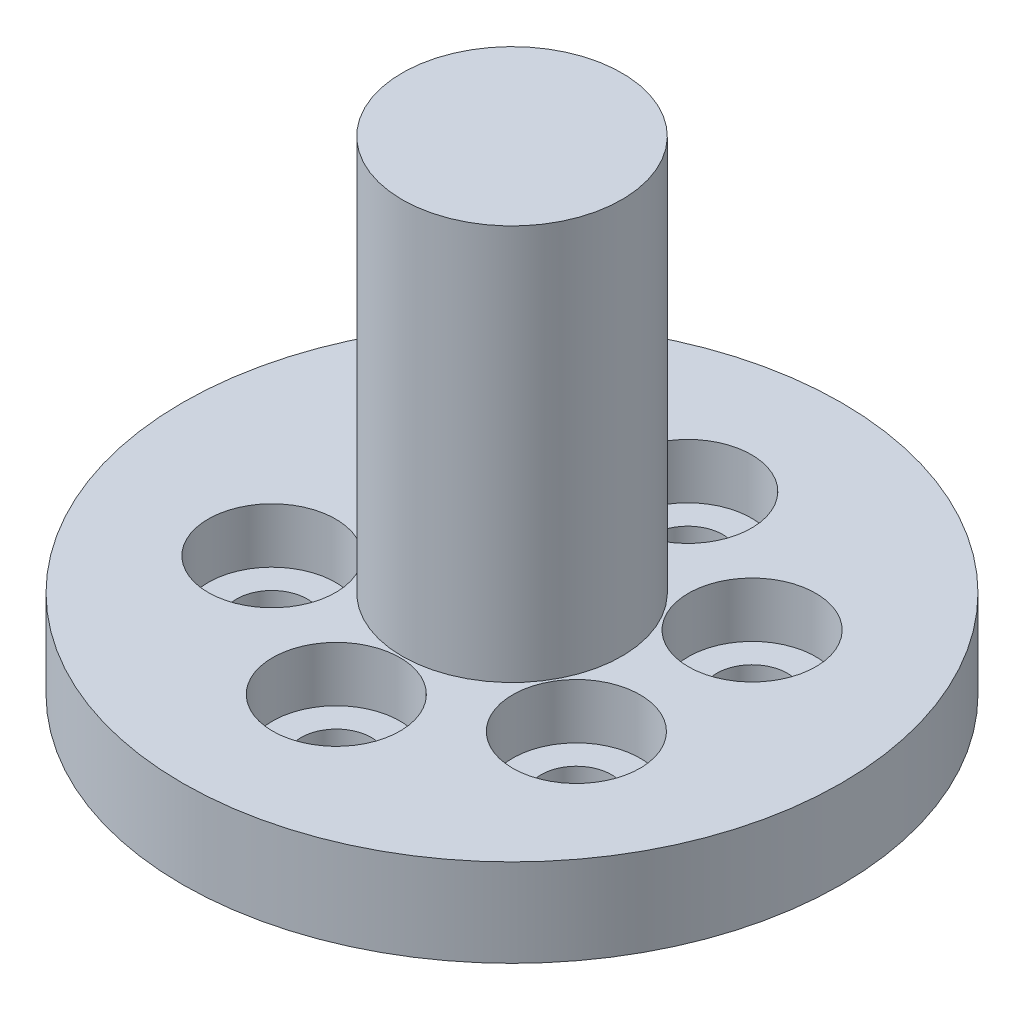
ISO-10303-21;
HEADER;
FILE_DESCRIPTION(('STEP AP214'),'2;1');
FILE_NAME('part.step','',(''),(''),'','','');
FILE_SCHEMA(('AUTOMOTIVE_DESIGN { 1 0 10303 214 1 1 1 1 }'));
ENDSEC;
DATA;
#1=APPLICATION_CONTEXT('core data for automotive mechanical design processes');
#2=APPLICATION_PROTOCOL_DEFINITION('international standard','automotive_design',2000,#1);
#3=PRODUCT_CONTEXT('',#1,'mechanical');
#4=PRODUCT('Part','Part','',(#3));
#5=PRODUCT_RELATED_PRODUCT_CATEGORY('part','',(#4));
#6=PRODUCT_DEFINITION_FORMATION('','',#4);
#7=PRODUCT_DEFINITION_CONTEXT('part definition',#1,'design');
#8=PRODUCT_DEFINITION('design','',#6,#7);
#9=PRODUCT_DEFINITION_SHAPE('','',#8);
#10=(LENGTH_UNIT() NAMED_UNIT(*) SI_UNIT(.MILLI.,.METRE.));
#11=(NAMED_UNIT(*) PLANE_ANGLE_UNIT() SI_UNIT($,.RADIAN.));
#12=(NAMED_UNIT(*) SI_UNIT($,.STERADIAN.) SOLID_ANGLE_UNIT());
#13=UNCERTAINTY_MEASURE_WITH_UNIT(LENGTH_MEASURE(1.E-05),#10,'distance_accuracy_value','');
#14=(GEOMETRIC_REPRESENTATION_CONTEXT(3) GLOBAL_UNCERTAINTY_ASSIGNED_CONTEXT((#13)) GLOBAL_UNIT_ASSIGNED_CONTEXT((#10,
#11,#12)) REPRESENTATION_CONTEXT('',''));
#15=CARTESIAN_POINT('',(0.,0.,0.));
#16=DIRECTION('',(0.,0.,1.));
#17=DIRECTION('',(1.,0.,0.));
#18=AXIS2_PLACEMENT_3D('',#15,#16,#17);
#19=CARTESIAN_POINT('',(6.92820323027568,-1.,-4.0000000000003));
#20=DIRECTION('',(0.,1.,0.));
#21=DIRECTION('',(0.,0.,1.));
#22=AXIS2_PLACEMENT_3D('',#19,#20,#21);
#23=CYLINDRICAL_SURFACE('',#22,1.6000000000001);
#24=CARTESIAN_POINT('',(6.92820323027568,0.,-4.0000000000003));
#25=DIRECTION('',(0.,1.,0.));
#26=DIRECTION('',(0.,0.,1.));
#27=AXIS2_PLACEMENT_3D('',#24,#25,#26);
#28=CIRCLE('',#27,1.6000000000001);
#29=CARTESIAN_POINT('',(6.92820323027568,0.,-2.4000000000002));
#30=VERTEX_POINT('',#29);
#31=EDGE_CURVE('E51',#30,#30,#28,.T.);
#32=ORIENTED_EDGE('',*,*,#31,.F.);
#33=EDGE_LOOP('',(#32));
#34=FACE_BOUND('',#33,.T.);
#35=CARTESIAN_POINT('',(6.92820323027568,1.5,-4.0000000000003));
#36=DIRECTION('',(0.,1.,0.));
#37=DIRECTION('',(0.,0.,1.));
#38=AXIS2_PLACEMENT_3D('',#35,#36,#37);
#39=CIRCLE('',#38,1.6000000000001);
#40=CARTESIAN_POINT('',(6.92820323027568,1.5,-2.4000000000002));
#41=VERTEX_POINT('',#40);
#42=EDGE_CURVE('E36',#41,#41,#39,.F.);
#43=ORIENTED_EDGE('',*,*,#42,.F.);
#44=EDGE_LOOP('',(#43));
#45=FACE_BOUND('',#44,.T.);
#46=ADVANCED_FACE('F32',(#34,#45),#23,.F.);
#47=CARTESIAN_POINT('',(6.92820323027602,-1.,3.9999999999997));
#48=DIRECTION('',(0.,1.,0.));
#49=DIRECTION('',(0.,0.,1.));
#50=AXIS2_PLACEMENT_3D('',#47,#48,#49);
#51=CYLINDRICAL_SURFACE('',#50,1.60000000000044);
#52=CARTESIAN_POINT('',(6.92820323027602,0.,3.9999999999997));
#53=DIRECTION('',(0.,1.,0.));
#54=DIRECTION('',(0.,0.,1.));
#55=AXIS2_PLACEMENT_3D('',#52,#53,#54);
#56=CIRCLE('',#55,1.60000000000044);
#57=CARTESIAN_POINT('',(6.92820323027602,0.,5.60000000000014));
#58=VERTEX_POINT('',#57);
#59=EDGE_CURVE('E54',#58,#58,#56,.T.);
#60=ORIENTED_EDGE('',*,*,#59,.F.);
#61=EDGE_LOOP('',(#60));
#62=FACE_BOUND('',#61,.T.);
#63=CARTESIAN_POINT('',(6.92820323027602,1.5,3.9999999999997));
#64=DIRECTION('',(0.,1.,0.));
#65=DIRECTION('',(0.,0.,1.));
#66=AXIS2_PLACEMENT_3D('',#63,#64,#65);
#67=CIRCLE('',#66,1.60000000000044);
#68=CARTESIAN_POINT('',(6.92820323027602,1.5,5.60000000000014));
#69=VERTEX_POINT('',#68);
#70=EDGE_CURVE('E80',#69,#69,#67,.F.);
#71=ORIENTED_EDGE('',*,*,#70,.F.);
#72=EDGE_LOOP('',(#71));
#73=FACE_BOUND('',#72,.T.);
#74=ADVANCED_FACE('F90',(#62,#73),#51,.F.);
#75=CARTESIAN_POINT('',(6.79181874011743E-13,-1.,8.));
#76=DIRECTION('',(0.,1.,0.));
#77=DIRECTION('',(0.,0.,1.));
#78=AXIS2_PLACEMENT_3D('',#75,#76,#77);
#79=CYLINDRICAL_SURFACE('',#78,1.6000000000007);
#80=CARTESIAN_POINT('',(6.79181874011743E-13,0.,8.));
#81=DIRECTION('',(0.,1.,0.));
#82=DIRECTION('',(0.,0.,1.));
#83=AXIS2_PLACEMENT_3D('',#80,#81,#82);
#84=CIRCLE('',#83,1.6000000000007);
#85=CARTESIAN_POINT('',(6.79181874011743E-13,0.,9.6000000000007));
#86=VERTEX_POINT('',#85);
#87=EDGE_CURVE('E57',#86,#86,#84,.T.);
#88=ORIENTED_EDGE('',*,*,#87,.F.);
#89=EDGE_LOOP('',(#88));
#90=FACE_BOUND('',#89,.T.);
#91=CARTESIAN_POINT('',(6.79181874011743E-13,1.5,8.));
#92=DIRECTION('',(0.,1.,0.));
#93=DIRECTION('',(0.,0.,1.));
#94=AXIS2_PLACEMENT_3D('',#91,#92,#93);
#95=CIRCLE('',#94,1.6000000000007);
#96=CARTESIAN_POINT('',(6.79181874011743E-13,1.5,9.6000000000007));
#97=VERTEX_POINT('',#96);
#98=EDGE_CURVE('E78',#97,#97,#95,.F.);
#99=ORIENTED_EDGE('',*,*,#98,.F.);
#100=EDGE_LOOP('',(#99));
#101=FACE_BOUND('',#100,.T.);
#102=ADVANCED_FACE('F96',(#90,#101),#79,.F.);
#103=CARTESIAN_POINT('',(-6.928203230275,-1.,4.0000000000003));
#104=DIRECTION('',(0.,1.,0.));
#105=DIRECTION('',(0.,0.,1.));
#106=AXIS2_PLACEMENT_3D('',#103,#104,#105);
#107=CYLINDRICAL_SURFACE('',#106,1.60000000000065);
#108=CARTESIAN_POINT('',(-6.928203230275,0.,4.0000000000003));
#109=DIRECTION('',(0.,1.,0.));
#110=DIRECTION('',(0.,0.,1.));
#111=AXIS2_PLACEMENT_3D('',#108,#109,#110);
#112=CIRCLE('',#111,1.60000000000065);
#113=CARTESIAN_POINT('',(-6.928203230275,0.,5.60000000000095));
#114=VERTEX_POINT('',#113);
#115=EDGE_CURVE('E60',#114,#114,#112,.T.);
#116=ORIENTED_EDGE('',*,*,#115,.F.);
#117=EDGE_LOOP('',(#116));
#118=FACE_BOUND('',#117,.T.);
#119=CARTESIAN_POINT('',(-6.928203230275,1.5,4.0000000000003));
#120=DIRECTION('',(0.,1.,0.));
#121=DIRECTION('',(0.,0.,1.));
#122=AXIS2_PLACEMENT_3D('',#119,#120,#121);
#123=CIRCLE('',#122,1.60000000000065);
#124=CARTESIAN_POINT('',(-6.928203230275,1.5,5.60000000000095));
#125=VERTEX_POINT('',#124);
#126=EDGE_CURVE('E75',#125,#125,#123,.F.);
#127=ORIENTED_EDGE('',*,*,#126,.F.);
#128=EDGE_LOOP('',(#127));
#129=FACE_BOUND('',#128,.T.);
#130=ADVANCED_FACE('F106',(#118,#129),#107,.F.);
#131=CARTESIAN_POINT('',(-6.92820323027534,-1.,-3.9999999999997));
#132=DIRECTION('',(0.,1.,0.));
#133=DIRECTION('',(0.,0.,1.));
#134=AXIS2_PLACEMENT_3D('',#131,#132,#133);
#135=CYLINDRICAL_SURFACE('',#134,1.60000000000034);
#136=CARTESIAN_POINT('',(-6.92820323027534,0.,-3.9999999999997));
#137=DIRECTION('',(0.,1.,0.));
#138=DIRECTION('',(0.,0.,1.));
#139=AXIS2_PLACEMENT_3D('',#136,#137,#138);
#140=CIRCLE('',#139,1.60000000000034);
#141=CARTESIAN_POINT('',(-6.92820323027534,0.,-2.39999999999936));
#142=VERTEX_POINT('',#141);
#143=EDGE_CURVE('E63',#142,#142,#140,.T.);
#144=ORIENTED_EDGE('',*,*,#143,.F.);
#145=EDGE_LOOP('',(#144));
#146=FACE_BOUND('',#145,.T.);
#147=CARTESIAN_POINT('',(-6.92820323027534,1.5,-3.9999999999997));
#148=DIRECTION('',(0.,1.,0.));
#149=DIRECTION('',(0.,0.,1.));
#150=AXIS2_PLACEMENT_3D('',#147,#148,#149);
#151=CIRCLE('',#150,1.60000000000034);
#152=CARTESIAN_POINT('',(-6.92820323027534,1.5,-2.39999999999936));
#153=VERTEX_POINT('',#152);
#154=EDGE_CURVE('E71',#153,#153,#151,.F.);
#155=ORIENTED_EDGE('',*,*,#154,.F.);
#156=EDGE_LOOP('',(#155));
#157=FACE_BOUND('',#156,.T.);
#158=ADVANCED_FACE('F101',(#146,#157),#135,.F.);
#159=CARTESIAN_POINT('',(0.,-1.,-8.));
#160=DIRECTION('',(0.,1.,0.));
#161=DIRECTION('',(0.,0.,1.));
#162=AXIS2_PLACEMENT_3D('',#159,#160,#161);
#163=CYLINDRICAL_SURFACE('',#162,1.6);
#164=CARTESIAN_POINT('',(0.,0.,-8.));
#165=DIRECTION('',(0.,1.,0.));
#166=DIRECTION('',(0.,0.,1.));
#167=AXIS2_PLACEMENT_3D('',#164,#165,#166);
#168=CIRCLE('',#167,1.6);
#169=CARTESIAN_POINT('',(0.,0.,-6.4));
#170=VERTEX_POINT('',#169);
#171=EDGE_CURVE('E45',#170,#170,#168,.T.);
#172=ORIENTED_EDGE('',*,*,#171,.F.);
#173=EDGE_LOOP('',(#172));
#174=FACE_BOUND('',#173,.T.);
#175=CARTESIAN_POINT('',(0.,1.5,-8.));
#176=DIRECTION('',(0.,1.,0.));
#177=DIRECTION('',(0.,0.,1.));
#178=AXIS2_PLACEMENT_3D('',#175,#176,#177);
#179=CIRCLE('',#178,1.6);
#180=CARTESIAN_POINT('',(0.,1.5,-6.4));
#181=VERTEX_POINT('',#180);
#182=EDGE_CURVE('E68',#181,#181,#179,.F.);
#183=ORIENTED_EDGE('',*,*,#182,.F.);
#184=EDGE_LOOP('',(#183));
#185=FACE_BOUND('',#184,.T.);
#186=ADVANCED_FACE('F142',(#174,#185),#163,.F.);
#187=CARTESIAN_POINT('',(0.,4.,0.));
#188=DIRECTION('',(0.,-1.,0.));
#189=DIRECTION('',(0.,0.,-1.));
#190=AXIS2_PLACEMENT_3D('',#187,#188,#189);
#191=CYLINDRICAL_SURFACE('',#190,15.);
#192=CARTESIAN_POINT('',(0.,4.,0.));
#193=DIRECTION('',(0.,1.,0.));
#194=DIRECTION('',(0.,0.,1.));
#195=AXIS2_PLACEMENT_3D('',#192,#193,#194);
#196=CIRCLE('',#195,15.);
#197=CARTESIAN_POINT('',(0.,4.,15.));
#198=VERTEX_POINT('',#197);
#199=EDGE_CURVE('E10',#198,#198,#196,.T.);
#200=ORIENTED_EDGE('',*,*,#199,.F.);
#201=EDGE_LOOP('',(#200));
#202=FACE_BOUND('',#201,.T.);
#203=CARTESIAN_POINT('',(0.,0.,0.));
#204=DIRECTION('',(0.,1.,0.));
#205=DIRECTION('',(0.,0.,1.));
#206=AXIS2_PLACEMENT_3D('',#203,#204,#205);
#207=CIRCLE('',#206,15.);
#208=CARTESIAN_POINT('',(0.,0.,15.));
#209=VERTEX_POINT('',#208);
#210=EDGE_CURVE('E40',#209,#209,#207,.T.);
#211=ORIENTED_EDGE('',*,*,#210,.T.);
#212=EDGE_LOOP('',(#211));
#213=FACE_BOUND('',#212,.T.);
#214=ADVANCED_FACE('F34',(#202,#213),#191,.T.);
#215=CARTESIAN_POINT('',(0.,4.,0.));
#216=DIRECTION('',(0.,1.,0.));
#217=DIRECTION('',(0.,0.,1.));
#218=AXIS2_PLACEMENT_3D('',#215,#216,#217);
#219=PLANE('',#218);
#220=CARTESIAN_POINT('',(0.,4.,0.));
#221=DIRECTION('',(0.,1.,0.));
#222=DIRECTION('',(0.,0.,1.));
#223=AXIS2_PLACEMENT_3D('',#220,#221,#222);
#224=CIRCLE('',#223,5.);
#225=CARTESIAN_POINT('',(0.,4.,5.));
#226=VERTEX_POINT('',#225);
#227=EDGE_CURVE('E216',#226,#226,#224,.T.);
#228=ORIENTED_EDGE('',*,*,#227,.F.);
#229=EDGE_LOOP('',(#228));
#230=FACE_BOUND('',#229,.T.);
#231=CARTESIAN_POINT('',(6.92870323027552,4.,-4.00086602540377));
#232=DIRECTION('',(0.,1.,0.));
#233=DIRECTION('',(0.,0.,1.));
#234=AXIS2_PLACEMENT_3D('',#231,#232,#233);
#235=CIRCLE('',#234,2.9);
#236=CARTESIAN_POINT('',(6.92870323027552,4.,-1.10086602540377));
#237=VERTEX_POINT('',#236);
#238=EDGE_CURVE('E235',#237,#237,#235,.T.);
#239=ORIENTED_EDGE('',*,*,#238,.F.);
#240=EDGE_LOOP('',(#239));
#241=FACE_BOUND('',#240,.T.);
#242=CARTESIAN_POINT('',(6.92970323027549,4.,3.99913397459625));
#243=DIRECTION('',(0.,1.,0.));
#244=DIRECTION('',(0.,0.,1.));
#245=AXIS2_PLACEMENT_3D('',#242,#243,#244);
#246=CIRCLE('',#245,2.9);
#247=CARTESIAN_POINT('',(6.92970323027549,4.,6.89913397459625));
#248=VERTEX_POINT('',#247);
#249=EDGE_CURVE('E241',#248,#248,#246,.T.);
#250=ORIENTED_EDGE('',*,*,#249,.F.);
#251=EDGE_LOOP('',(#250));
#252=FACE_BOUND('',#251,.T.);
#253=CARTESIAN_POINT('',(0.00199999999994414,4.,8.));
#254=DIRECTION('',(0.,1.,0.));
#255=DIRECTION('',(0.,0.,1.));
#256=AXIS2_PLACEMENT_3D('',#253,#254,#255);
#257=CIRCLE('',#256,2.9);
#258=CARTESIAN_POINT('',(0.00199999999994414,4.,10.9));
#259=VERTEX_POINT('',#258);
#260=EDGE_CURVE('E247',#259,#259,#257,.T.);
#261=ORIENTED_EDGE('',*,*,#260,.F.);
#262=EDGE_LOOP('',(#261));
#263=FACE_BOUND('',#262,.T.);
#264=CARTESIAN_POINT('',(-6.92670323027555,4.,4.00086602540372));
#265=DIRECTION('',(0.,1.,0.));
#266=DIRECTION('',(0.,0.,1.));
#267=AXIS2_PLACEMENT_3D('',#264,#265,#266);
#268=CIRCLE('',#267,2.9);
#269=CARTESIAN_POINT('',(-6.92670323027555,4.,6.90086602540372));
#270=VERTEX_POINT('',#269);
#271=EDGE_CURVE('E229',#270,#270,#268,.T.);
#272=ORIENTED_EDGE('',*,*,#271,.F.);
#273=EDGE_LOOP('',(#272));
#274=FACE_BOUND('',#273,.T.);
#275=CARTESIAN_POINT('',(-6.92770323027546,4.,-3.9991339745963));
#276=DIRECTION('',(0.,1.,0.));
#277=DIRECTION('',(0.,0.,1.));
#278=AXIS2_PLACEMENT_3D('',#275,#276,#277);
#279=CIRCLE('',#278,2.9);
#280=CARTESIAN_POINT('',(-6.92770323027546,4.,-1.0991339745963));
#281=VERTEX_POINT('',#280);
#282=EDGE_CURVE('E224',#281,#281,#279,.T.);
#283=ORIENTED_EDGE('',*,*,#282,.F.);
#284=EDGE_LOOP('',(#283));
#285=FACE_BOUND('',#284,.T.);
#286=CARTESIAN_POINT('',(0.,4.,-8.));
#287=DIRECTION('',(0.,1.,0.));
#288=DIRECTION('',(0.,0.,1.));
#289=AXIS2_PLACEMENT_3D('',#286,#287,#288);
#290=CIRCLE('',#289,2.9);
#291=CARTESIAN_POINT('',(0.,4.,-5.1));
#292=VERTEX_POINT('',#291);
#293=EDGE_CURVE('E48',#292,#292,#290,.T.);
#294=ORIENTED_EDGE('',*,*,#293,.F.);
#295=EDGE_LOOP('',(#294));
#296=FACE_BOUND('',#295,.T.);
#297=ORIENTED_EDGE('',*,*,#199,.T.);
#298=EDGE_LOOP('',(#297));
#299=FACE_BOUND('',#298,.T.);
#300=ADVANCED_FACE('F111',(#230,#241,#252,#263,#274,#285,#296,#299),#219,.T.);
#301=CARTESIAN_POINT('',(0.,0.,0.));
#302=DIRECTION('',(0.,1.,0.));
#303=DIRECTION('',(0.,0.,1.));
#304=AXIS2_PLACEMENT_3D('',#301,#302,#303);
#305=PLANE('',#304);
#306=CARTESIAN_POINT('',(0.,0.,0.));
#307=DIRECTION('',(0.,-1.,0.));
#308=DIRECTION('',(0.,0.,-1.));
#309=AXIS2_PLACEMENT_3D('',#306,#307,#308);
#310=CIRCLE('',#309,4.);
#311=CARTESIAN_POINT('',(0.,0.,-4.));
#312=VERTEX_POINT('',#311);
#313=EDGE_CURVE('E127',#312,#312,#310,.T.);
#314=ORIENTED_EDGE('',*,*,#313,.F.);
#315=EDGE_LOOP('',(#314));
#316=FACE_BOUND('',#315,.T.);
#317=ORIENTED_EDGE('',*,*,#171,.T.);
#318=EDGE_LOOP('',(#317));
#319=FACE_BOUND('',#318,.T.);
#320=ORIENTED_EDGE('',*,*,#143,.T.);
#321=EDGE_LOOP('',(#320));
#322=FACE_BOUND('',#321,.T.);
#323=ORIENTED_EDGE('',*,*,#115,.T.);
#324=EDGE_LOOP('',(#323));
#325=FACE_BOUND('',#324,.T.);
#326=ORIENTED_EDGE('',*,*,#87,.T.);
#327=EDGE_LOOP('',(#326));
#328=FACE_BOUND('',#327,.T.);
#329=ORIENTED_EDGE('',*,*,#59,.T.);
#330=EDGE_LOOP('',(#329));
#331=FACE_BOUND('',#330,.T.);
#332=ORIENTED_EDGE('',*,*,#31,.T.);
#333=EDGE_LOOP('',(#332));
#334=FACE_BOUND('',#333,.T.);
#335=ORIENTED_EDGE('',*,*,#210,.F.);
#336=EDGE_LOOP('',(#335));
#337=FACE_BOUND('',#336,.T.);
#338=ADVANCED_FACE('F113',(#316,#319,#322,#325,#328,#331,#334,#337),#305,.F.);
#339=CARTESIAN_POINT('',(0.,1.5,-8.));
#340=DIRECTION('',(0.,1.,0.));
#341=DIRECTION('',(0.,0.,1.));
#342=AXIS2_PLACEMENT_3D('',#339,#340,#341);
#343=PLANE('',#342);
#344=CARTESIAN_POINT('',(0.,1.5,-8.));
#345=DIRECTION('',(0.,1.,0.));
#346=DIRECTION('',(0.,0.,1.));
#347=AXIS2_PLACEMENT_3D('',#344,#345,#346);
#348=CIRCLE('',#347,2.9);
#349=CARTESIAN_POINT('',(0.,1.5,-5.1));
#350=VERTEX_POINT('',#349);
#351=EDGE_CURVE('E72',#350,#350,#348,.T.);
#352=ORIENTED_EDGE('',*,*,#351,.T.);
#353=EDGE_LOOP('',(#352));
#354=FACE_BOUND('',#353,.T.);
#355=ORIENTED_EDGE('',*,*,#182,.T.);
#356=EDGE_LOOP('',(#355));
#357=FACE_BOUND('',#356,.T.);
#358=ADVANCED_FACE('F116',(#354,#357),#343,.T.);
#359=CARTESIAN_POINT('',(0.,1.5,-8.));
#360=DIRECTION('',(0.,1.,0.));
#361=DIRECTION('',(0.,0.,1.));
#362=AXIS2_PLACEMENT_3D('',#359,#360,#361);
#363=CYLINDRICAL_SURFACE('',#362,2.9);
#364=ORIENTED_EDGE('',*,*,#351,.F.);
#365=EDGE_LOOP('',(#364));
#366=FACE_BOUND('',#365,.T.);
#367=ORIENTED_EDGE('',*,*,#293,.T.);
#368=EDGE_LOOP('',(#367));
#369=FACE_BOUND('',#368,.T.);
#370=ADVANCED_FACE('F121',(#366,#369),#363,.F.);
#371=CARTESIAN_POINT('',(-6.92770323027546,1.5,-3.9991339745963));
#372=DIRECTION('',(0.,1.,0.));
#373=DIRECTION('',(0.,0.,1.));
#374=AXIS2_PLACEMENT_3D('',#371,#372,#373);
#375=PLANE('',#374);
#376=CARTESIAN_POINT('',(-6.92770323027546,1.5,-3.9991339745963));
#377=DIRECTION('',(0.,1.,0.));
#378=DIRECTION('',(0.,0.,1.));
#379=AXIS2_PLACEMENT_3D('',#376,#377,#378);
#380=CIRCLE('',#379,2.9);
#381=CARTESIAN_POINT('',(-6.92770323027546,1.5,-1.0991339745963));
#382=VERTEX_POINT('',#381);
#383=EDGE_CURVE('E226',#382,#382,#380,.T.);
#384=ORIENTED_EDGE('',*,*,#383,.T.);
#385=EDGE_LOOP('',(#384));
#386=FACE_BOUND('',#385,.T.);
#387=ORIENTED_EDGE('',*,*,#154,.T.);
#388=EDGE_LOOP('',(#387));
#389=FACE_BOUND('',#388,.T.);
#390=ADVANCED_FACE('F155',(#386,#389),#375,.T.);
#391=CARTESIAN_POINT('',(-6.92770323027546,1.5,-3.9991339745963));
#392=DIRECTION('',(0.,1.,0.));
#393=DIRECTION('',(0.,0.,1.));
#394=AXIS2_PLACEMENT_3D('',#391,#392,#393);
#395=CYLINDRICAL_SURFACE('',#394,2.9);
#396=ORIENTED_EDGE('',*,*,#383,.F.);
#397=EDGE_LOOP('',(#396));
#398=FACE_BOUND('',#397,.T.);
#399=ORIENTED_EDGE('',*,*,#282,.T.);
#400=EDGE_LOOP('',(#399));
#401=FACE_BOUND('',#400,.T.);
#402=ADVANCED_FACE('F166',(#398,#401),#395,.F.);
#403=CARTESIAN_POINT('',(-6.92670323027555,1.5,4.00086602540372));
#404=DIRECTION('',(0.,1.,0.));
#405=DIRECTION('',(0.,0.,1.));
#406=AXIS2_PLACEMENT_3D('',#403,#404,#405);
#407=PLANE('',#406);
#408=CARTESIAN_POINT('',(-6.92670323027555,1.5,4.00086602540372));
#409=DIRECTION('',(0.,1.,0.));
#410=DIRECTION('',(0.,0.,1.));
#411=AXIS2_PLACEMENT_3D('',#408,#409,#410);
#412=CIRCLE('',#411,2.9);
#413=CARTESIAN_POINT('',(-6.92670323027555,1.5,6.90086602540372));
#414=VERTEX_POINT('',#413);
#415=EDGE_CURVE('E250',#414,#414,#412,.T.);
#416=ORIENTED_EDGE('',*,*,#415,.T.);
#417=EDGE_LOOP('',(#416));
#418=FACE_BOUND('',#417,.T.);
#419=ORIENTED_EDGE('',*,*,#126,.T.);
#420=EDGE_LOOP('',(#419));
#421=FACE_BOUND('',#420,.T.);
#422=ADVANCED_FACE('F162',(#418,#421),#407,.T.);
#423=CARTESIAN_POINT('',(-6.92670323027555,1.5,4.00086602540372));
#424=DIRECTION('',(0.,1.,0.));
#425=DIRECTION('',(0.,0.,1.));
#426=AXIS2_PLACEMENT_3D('',#423,#424,#425);
#427=CYLINDRICAL_SURFACE('',#426,2.9);
#428=ORIENTED_EDGE('',*,*,#415,.F.);
#429=EDGE_LOOP('',(#428));
#430=FACE_BOUND('',#429,.T.);
#431=ORIENTED_EDGE('',*,*,#271,.T.);
#432=EDGE_LOOP('',(#431));
#433=FACE_BOUND('',#432,.T.);
#434=ADVANCED_FACE('F158',(#430,#433),#427,.F.);
#435=CARTESIAN_POINT('',(0.00199999999994414,1.5,8.));
#436=DIRECTION('',(0.,1.,0.));
#437=DIRECTION('',(0.,0.,1.));
#438=AXIS2_PLACEMENT_3D('',#435,#436,#437);
#439=PLANE('',#438);
#440=CARTESIAN_POINT('',(0.00199999999994414,1.5,8.));
#441=DIRECTION('',(0.,1.,0.));
#442=DIRECTION('',(0.,0.,1.));
#443=AXIS2_PLACEMENT_3D('',#440,#441,#442);
#444=CIRCLE('',#443,2.9);
#445=CARTESIAN_POINT('',(0.00199999999994414,1.5,10.9));
#446=VERTEX_POINT('',#445);
#447=EDGE_CURVE('E244',#446,#446,#444,.T.);
#448=ORIENTED_EDGE('',*,*,#447,.T.);
#449=EDGE_LOOP('',(#448));
#450=FACE_BOUND('',#449,.T.);
#451=ORIENTED_EDGE('',*,*,#98,.T.);
#452=EDGE_LOOP('',(#451));
#453=FACE_BOUND('',#452,.T.);
#454=ADVANCED_FACE('F161',(#450,#453),#439,.T.);
#455=CARTESIAN_POINT('',(0.00199999999994414,1.5,8.));
#456=DIRECTION('',(0.,1.,0.));
#457=DIRECTION('',(0.,0.,1.));
#458=AXIS2_PLACEMENT_3D('',#455,#456,#457);
#459=CYLINDRICAL_SURFACE('',#458,2.9);
#460=ORIENTED_EDGE('',*,*,#447,.F.);
#461=EDGE_LOOP('',(#460));
#462=FACE_BOUND('',#461,.T.);
#463=ORIENTED_EDGE('',*,*,#260,.T.);
#464=EDGE_LOOP('',(#463));
#465=FACE_BOUND('',#464,.T.);
#466=ADVANCED_FACE('F168',(#462,#465),#459,.F.);
#467=CARTESIAN_POINT('',(6.92970323027549,1.5,3.99913397459625));
#468=DIRECTION('',(0.,1.,0.));
#469=DIRECTION('',(0.,0.,1.));
#470=AXIS2_PLACEMENT_3D('',#467,#468,#469);
#471=PLANE('',#470);
#472=CARTESIAN_POINT('',(6.92970323027549,1.5,3.99913397459625));
#473=DIRECTION('',(0.,1.,0.));
#474=DIRECTION('',(0.,0.,1.));
#475=AXIS2_PLACEMENT_3D('',#472,#473,#474);
#476=CIRCLE('',#475,2.9);
#477=CARTESIAN_POINT('',(6.92970323027549,1.5,6.89913397459625));
#478=VERTEX_POINT('',#477);
#479=EDGE_CURVE('E238',#478,#478,#476,.T.);
#480=ORIENTED_EDGE('',*,*,#479,.T.);
#481=EDGE_LOOP('',(#480));
#482=FACE_BOUND('',#481,.T.);
#483=ORIENTED_EDGE('',*,*,#70,.T.);
#484=EDGE_LOOP('',(#483));
#485=FACE_BOUND('',#484,.T.);
#486=ADVANCED_FACE('F171',(#482,#485),#471,.T.);
#487=CARTESIAN_POINT('',(6.92970323027549,1.5,3.99913397459625));
#488=DIRECTION('',(0.,1.,0.));
#489=DIRECTION('',(0.,0.,1.));
#490=AXIS2_PLACEMENT_3D('',#487,#488,#489);
#491=CYLINDRICAL_SURFACE('',#490,2.9);
#492=ORIENTED_EDGE('',*,*,#479,.F.);
#493=EDGE_LOOP('',(#492));
#494=FACE_BOUND('',#493,.T.);
#495=ORIENTED_EDGE('',*,*,#249,.T.);
#496=EDGE_LOOP('',(#495));
#497=FACE_BOUND('',#496,.T.);
#498=ADVANCED_FACE('F176',(#494,#497),#491,.F.);
#499=CARTESIAN_POINT('',(6.92870323027552,1.5,-4.00086602540377));
#500=DIRECTION('',(0.,1.,0.));
#501=DIRECTION('',(0.,0.,1.));
#502=AXIS2_PLACEMENT_3D('',#499,#500,#501);
#503=PLANE('',#502);
#504=CARTESIAN_POINT('',(6.92870323027552,1.5,-4.00086602540377));
#505=DIRECTION('',(0.,1.,0.));
#506=DIRECTION('',(0.,0.,1.));
#507=AXIS2_PLACEMENT_3D('',#504,#505,#506);
#508=CIRCLE('',#507,2.9);
#509=CARTESIAN_POINT('',(6.92870323027552,1.5,-1.10086602540377));
#510=VERTEX_POINT('',#509);
#511=EDGE_CURVE('E232',#510,#510,#508,.T.);
#512=ORIENTED_EDGE('',*,*,#511,.T.);
#513=EDGE_LOOP('',(#512));
#514=FACE_BOUND('',#513,.T.);
#515=ORIENTED_EDGE('',*,*,#42,.T.);
#516=EDGE_LOOP('',(#515));
#517=FACE_BOUND('',#516,.T.);
#518=ADVANCED_FACE('F87',(#514,#517),#503,.T.);
#519=CARTESIAN_POINT('',(6.92870323027552,1.5,-4.00086602540377));
#520=DIRECTION('',(0.,1.,0.));
#521=DIRECTION('',(0.,0.,1.));
#522=AXIS2_PLACEMENT_3D('',#519,#520,#521);
#523=CYLINDRICAL_SURFACE('',#522,2.9);
#524=ORIENTED_EDGE('',*,*,#511,.F.);
#525=EDGE_LOOP('',(#524));
#526=FACE_BOUND('',#525,.T.);
#527=ORIENTED_EDGE('',*,*,#238,.T.);
#528=EDGE_LOOP('',(#527));
#529=FACE_BOUND('',#528,.T.);
#530=ADVANCED_FACE('F183',(#526,#529),#523,.F.);
#531=CARTESIAN_POINT('',(0.,22.,0.));
#532=DIRECTION('',(0.,-1.,0.));
#533=DIRECTION('',(0.,0.,-1.));
#534=AXIS2_PLACEMENT_3D('',#531,#532,#533);
#535=CYLINDRICAL_SURFACE('',#534,5.);
#536=CARTESIAN_POINT('',(0.,22.,0.));
#537=DIRECTION('',(0.,1.,0.));
#538=DIRECTION('',(0.,0.,1.));
#539=AXIS2_PLACEMENT_3D('',#536,#537,#538);
#540=CIRCLE('',#539,5.);
#541=CARTESIAN_POINT('',(0.,22.,5.));
#542=VERTEX_POINT('',#541);
#543=EDGE_CURVE('E219',#542,#542,#540,.T.);
#544=ORIENTED_EDGE('',*,*,#543,.F.);
#545=EDGE_LOOP('',(#544));
#546=FACE_BOUND('',#545,.T.);
#547=ORIENTED_EDGE('',*,*,#227,.T.);
#548=EDGE_LOOP('',(#547));
#549=FACE_BOUND('',#548,.T.);
#550=ADVANCED_FACE('F186',(#546,#549),#535,.T.);
#551=CARTESIAN_POINT('',(0.,22.,0.));
#552=DIRECTION('',(0.,1.,0.));
#553=DIRECTION('',(0.,0.,1.));
#554=AXIS2_PLACEMENT_3D('',#551,#552,#553);
#555=PLANE('',#554);
#556=ORIENTED_EDGE('',*,*,#543,.T.);
#557=EDGE_LOOP('',(#556));
#558=FACE_BOUND('',#557,.T.);
#559=ADVANCED_FACE('F199',(#558),#555,.T.);
#560=CARTESIAN_POINT('',(0.,2.,0.));
#561=DIRECTION('',(0.,-1.,0.));
#562=DIRECTION('',(0.,0.,-1.));
#563=AXIS2_PLACEMENT_3D('',#560,#561,#562);
#564=CYLINDRICAL_SURFACE('',#563,4.);
#565=CARTESIAN_POINT('',(0.,2.,0.));
#566=DIRECTION('',(0.,-1.,0.));
#567=DIRECTION('',(0.,0.,-1.));
#568=AXIS2_PLACEMENT_3D('',#565,#566,#567);
#569=CIRCLE('',#568,4.);
#570=CARTESIAN_POINT('',(0.,2.,-4.));
#571=VERTEX_POINT('',#570);
#572=EDGE_CURVE('E215',#571,#571,#569,.T.);
#573=ORIENTED_EDGE('',*,*,#572,.F.);
#574=EDGE_LOOP('',(#573));
#575=FACE_BOUND('',#574,.T.);
#576=ORIENTED_EDGE('',*,*,#313,.T.);
#577=EDGE_LOOP('',(#576));
#578=FACE_BOUND('',#577,.T.);
#579=ADVANCED_FACE('F203',(#575,#578),#564,.F.);
#580=CARTESIAN_POINT('',(0.,2.,0.));
#581=DIRECTION('',(0.,-1.,0.));
#582=DIRECTION('',(0.,0.,-1.));
#583=AXIS2_PLACEMENT_3D('',#580,#581,#582);
#584=PLANE('',#583);
#585=ORIENTED_EDGE('',*,*,#572,.T.);
#586=EDGE_LOOP('',(#585));
#587=FACE_BOUND('',#586,.T.);
#588=ADVANCED_FACE('F207',(#587),#584,.T.);
#589=CLOSED_SHELL('',(#46,#74,#102,#130,#158,#186,#214,#300,#338,#358,#370,#390,#402,#422,#434,
#454,#466,#486,#498,#518,#530,#550,#559,#579,#588));
#590=MANIFOLD_SOLID_BREP('B2',#589);
#591=ADVANCED_BREP_SHAPE_REPRESENTATION('',(#18,#590),#14);
#592=SHAPE_DEFINITION_REPRESENTATION(#9,#591);
ENDSEC;
END-ISO-10303-21;
